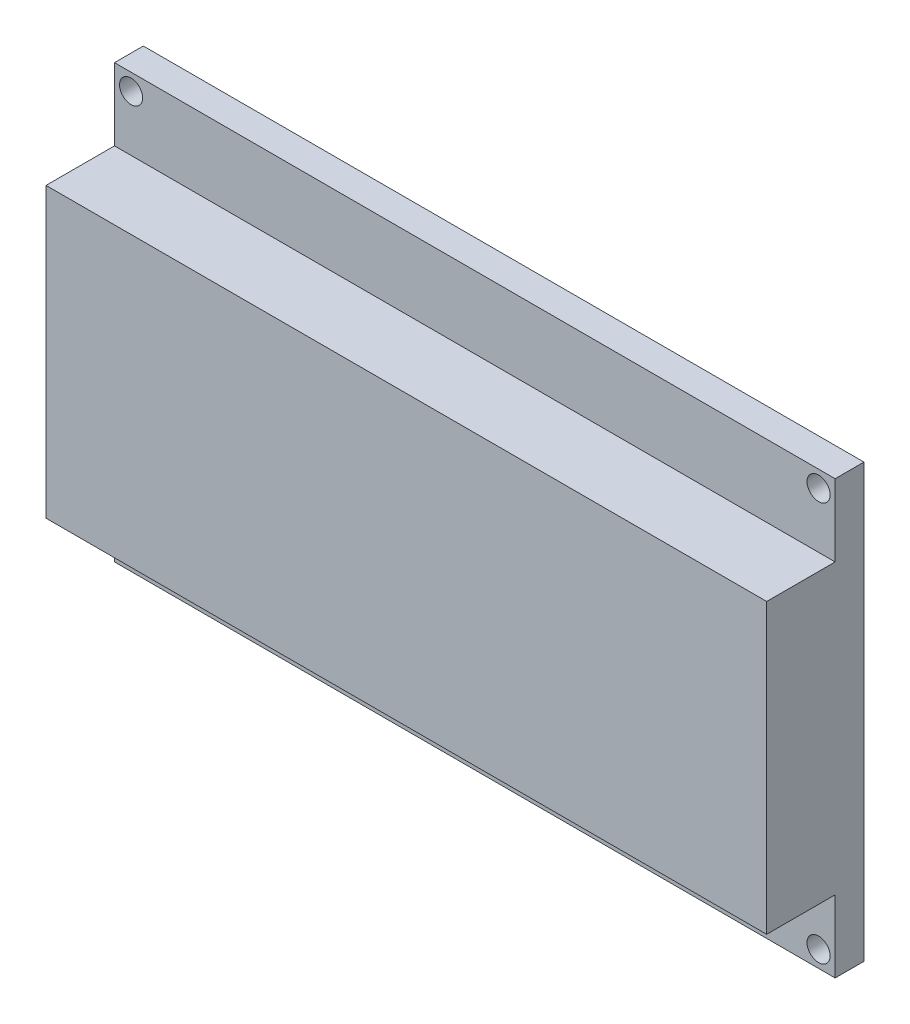
ISO-10303-21;
HEADER;
FILE_DESCRIPTION(('STEP AP214'),'2;1');
FILE_NAME('part.step','',(''),(''),'','','');
FILE_SCHEMA(('AUTOMOTIVE_DESIGN { 1 0 10303 214 1 1 1 1 }'));
ENDSEC;
DATA;
#1=APPLICATION_CONTEXT('core data for automotive mechanical design processes');
#2=APPLICATION_PROTOCOL_DEFINITION('international standard','automotive_design',2000,#1);
#3=PRODUCT_CONTEXT('',#1,'mechanical');
#4=PRODUCT('Part','Part','',(#3));
#5=PRODUCT_RELATED_PRODUCT_CATEGORY('part','',(#4));
#6=PRODUCT_DEFINITION_FORMATION('','',#4);
#7=PRODUCT_DEFINITION_CONTEXT('part definition',#1,'design');
#8=PRODUCT_DEFINITION('design','',#6,#7);
#9=PRODUCT_DEFINITION_SHAPE('','',#8);
#10=(LENGTH_UNIT() NAMED_UNIT(*) SI_UNIT(.MILLI.,.METRE.));
#11=(NAMED_UNIT(*) PLANE_ANGLE_UNIT() SI_UNIT($,.RADIAN.));
#12=(NAMED_UNIT(*) SI_UNIT($,.STERADIAN.) SOLID_ANGLE_UNIT());
#13=UNCERTAINTY_MEASURE_WITH_UNIT(LENGTH_MEASURE(1.E-05),#10,'distance_accuracy_value','');
#14=(GEOMETRIC_REPRESENTATION_CONTEXT(3) GLOBAL_UNCERTAINTY_ASSIGNED_CONTEXT((#13)) GLOBAL_UNIT_ASSIGNED_CONTEXT((#10,
#11,#12)) REPRESENTATION_CONTEXT('',''));
#15=CARTESIAN_POINT('',(0.,0.,0.));
#16=DIRECTION('',(0.,0.,1.));
#17=DIRECTION('',(1.,0.,0.));
#18=AXIS2_PLACEMENT_3D('',#15,#16,#17);
#19=CARTESIAN_POINT('',(0.,0.,4.));
#20=DIRECTION('',(0.,0.,-1.));
#21=DIRECTION('',(-1.,0.,0.));
#22=AXIS2_PLACEMENT_3D('',#19,#20,#21);
#23=PLANE('',#22);
#24=CARTESIAN_POINT('',(97.6999999999997,57.7,4.));
#25=DIRECTION('',(0.,0.,1.));
#26=DIRECTION('',(1.,0.,0.));
#27=AXIS2_PLACEMENT_3D('',#24,#25,#26);
#28=CIRCLE('',#27,1.60000000000001);
#29=CARTESIAN_POINT('',(99.2999999999997,57.7,4.));
#30=VERTEX_POINT('',#29);
#31=EDGE_CURVE('E139',#30,#30,#28,.T.);
#32=ORIENTED_EDGE('',*,*,#31,.F.);
#33=EDGE_LOOP('',(#32));
#34=FACE_BOUND('',#33,.T.);
#35=CARTESIAN_POINT('',(2.3,57.7,4.));
#36=DIRECTION('',(0.,0.,1.));
#37=DIRECTION('',(1.,0.,0.));
#38=AXIS2_PLACEMENT_3D('',#35,#36,#37);
#39=CIRCLE('',#38,1.6);
#40=CARTESIAN_POINT('',(3.9,57.7,4.));
#41=VERTEX_POINT('',#40);
#42=EDGE_CURVE('E145',#41,#41,#39,.T.);
#43=ORIENTED_EDGE('',*,*,#42,.F.);
#44=EDGE_LOOP('',(#43));
#45=FACE_BOUND('',#44,.T.);
#46=DIRECTION('',(-1.,0.,0.));
#47=VECTOR('',#46,1.);
#48=CARTESIAN_POINT('',(0.,50.,4.));
#49=LINE('',#48,#47);
#50=CARTESIAN_POINT('',(100.,50.,4.));
#51=VERTEX_POINT('',#50);
#52=CARTESIAN_POINT('',(0.,50.,4.));
#53=VERTEX_POINT('',#52);
#54=EDGE_CURVE('E48',#51,#53,#49,.T.);
#55=ORIENTED_EDGE('',*,*,#54,.F.);
#56=DIRECTION('',(0.,1.,0.));
#57=VECTOR('',#56,1.);
#58=CARTESIAN_POINT('',(100.,0.,4.));
#59=LINE('',#58,#57);
#60=CARTESIAN_POINT('',(100.,60.,4.));
#61=VERTEX_POINT('',#60);
#62=EDGE_CURVE('E155',#51,#61,#59,.T.);
#63=ORIENTED_EDGE('',*,*,#62,.T.);
#64=DIRECTION('',(-1.,0.,0.));
#65=VECTOR('',#64,1.);
#66=CARTESIAN_POINT('',(0.,60.,4.));
#67=LINE('',#66,#65);
#68=CARTESIAN_POINT('',(0.,60.,4.));
#69=VERTEX_POINT('',#68);
#70=EDGE_CURVE('E158',#61,#69,#67,.T.);
#71=ORIENTED_EDGE('',*,*,#70,.T.);
#72=DIRECTION('',(0.,-1.,0.));
#73=VECTOR('',#72,1.);
#74=CARTESIAN_POINT('',(0.,0.,4.));
#75=LINE('',#74,#73);
#76=EDGE_CURVE('E151',#69,#53,#75,.T.);
#77=ORIENTED_EDGE('',*,*,#76,.T.);
#78=EDGE_LOOP('',(#55,#63,#71,#77));
#79=FACE_BOUND('',#78,.T.);
#80=ADVANCED_FACE('F33',(#34,#45,#79),#23,.F.);
#81=CARTESIAN_POINT('',(2.30000000000033,2.3,4.));
#82=DIRECTION('',(0.,0.,1.));
#83=DIRECTION('',(1.,0.,0.));
#84=AXIS2_PLACEMENT_3D('',#81,#82,#83);
#85=CIRCLE('',#84,1.6);
#86=CARTESIAN_POINT('',(3.90000000000033,2.3,4.));
#87=VERTEX_POINT('',#86);
#88=EDGE_CURVE('E124',#87,#87,#85,.T.);
#89=ORIENTED_EDGE('',*,*,#88,.F.);
#90=EDGE_LOOP('',(#89));
#91=FACE_BOUND('',#90,.T.);
#92=CARTESIAN_POINT('',(97.7,2.3,4.));
#93=DIRECTION('',(0.,0.,1.));
#94=DIRECTION('',(1.,0.,0.));
#95=AXIS2_PLACEMENT_3D('',#92,#93,#94);
#96=CIRCLE('',#95,1.60000000000001);
#97=CARTESIAN_POINT('',(99.3,2.3,4.));
#98=VERTEX_POINT('',#97);
#99=EDGE_CURVE('E133',#98,#98,#96,.T.);
#100=ORIENTED_EDGE('',*,*,#99,.F.);
#101=EDGE_LOOP('',(#100));
#102=FACE_BOUND('',#101,.T.);
#103=DIRECTION('',(1.,0.,0.));
#104=VECTOR('',#103,1.);
#105=CARTESIAN_POINT('',(0.,10.,4.));
#106=LINE('',#105,#104);
#107=CARTESIAN_POINT('',(0.,10.,4.));
#108=VERTEX_POINT('',#107);
#109=CARTESIAN_POINT('',(100.,10.,4.));
#110=VERTEX_POINT('',#109);
#111=EDGE_CURVE('E56',#108,#110,#106,.T.);
#112=ORIENTED_EDGE('',*,*,#111,.F.);
#113=CARTESIAN_POINT('',(0.,0.,4.));
#114=VERTEX_POINT('',#113);
#115=EDGE_CURVE('E120',#108,#114,#75,.T.);
#116=ORIENTED_EDGE('',*,*,#115,.T.);
#117=DIRECTION('',(1.,0.,0.));
#118=VECTOR('',#117,1.);
#119=CARTESIAN_POINT('',(0.,0.,4.));
#120=LINE('',#119,#118);
#121=CARTESIAN_POINT('',(100.,0.,4.));
#122=VERTEX_POINT('',#121);
#123=EDGE_CURVE('E153',#114,#122,#120,.T.);
#124=ORIENTED_EDGE('',*,*,#123,.T.);
#125=EDGE_CURVE('E156',#122,#110,#59,.T.);
#126=ORIENTED_EDGE('',*,*,#125,.T.);
#127=EDGE_LOOP('',(#112,#116,#124,#126));
#128=FACE_BOUND('',#127,.T.);
#129=ADVANCED_FACE('F211',(#91,#102,#128),#23,.F.);
#130=CARTESIAN_POINT('',(0.,0.,0.));
#131=DIRECTION('',(0.,0.,-1.));
#132=DIRECTION('',(-1.,0.,0.));
#133=AXIS2_PLACEMENT_3D('',#130,#131,#132);
#134=PLANE('',#133);
#135=CARTESIAN_POINT('',(97.7,2.3,0.));
#136=DIRECTION('',(0.,0.,1.));
#137=DIRECTION('',(1.,0.,0.));
#138=AXIS2_PLACEMENT_3D('',#135,#136,#137);
#139=CIRCLE('',#138,1.60000000000001);
#140=CARTESIAN_POINT('',(99.3,2.3,0.));
#141=VERTEX_POINT('',#140);
#142=EDGE_CURVE('E131',#141,#141,#139,.T.);
#143=ORIENTED_EDGE('',*,*,#142,.T.);
#144=EDGE_LOOP('',(#143));
#145=FACE_BOUND('',#144,.T.);
#146=CARTESIAN_POINT('',(2.3,57.7,0.));
#147=DIRECTION('',(0.,0.,1.));
#148=DIRECTION('',(1.,0.,0.));
#149=AXIS2_PLACEMENT_3D('',#146,#147,#148);
#150=CIRCLE('',#149,1.6);
#151=CARTESIAN_POINT('',(3.9,57.7,0.));
#152=VERTEX_POINT('',#151);
#153=EDGE_CURVE('E142',#152,#152,#150,.T.);
#154=ORIENTED_EDGE('',*,*,#153,.T.);
#155=EDGE_LOOP('',(#154));
#156=FACE_BOUND('',#155,.T.);
#157=DIRECTION('',(0.,-1.,0.));
#158=VECTOR('',#157,1.);
#159=CARTESIAN_POINT('',(0.,0.,0.));
#160=LINE('',#159,#158);
#161=CARTESIAN_POINT('',(0.,60.,0.));
#162=VERTEX_POINT('',#161);
#163=CARTESIAN_POINT('',(0.,0.,0.));
#164=VERTEX_POINT('',#163);
#165=EDGE_CURVE('E148',#162,#164,#160,.T.);
#166=ORIENTED_EDGE('',*,*,#165,.F.);
#167=DIRECTION('',(-1.,0.,0.));
#168=VECTOR('',#167,1.);
#169=CARTESIAN_POINT('',(0.,60.,0.));
#170=LINE('',#169,#168);
#171=CARTESIAN_POINT('',(100.,60.,0.));
#172=VERTEX_POINT('',#171);
#173=EDGE_CURVE('E166',#172,#162,#170,.T.);
#174=ORIENTED_EDGE('',*,*,#173,.F.);
#175=DIRECTION('',(0.,1.,0.));
#176=VECTOR('',#175,1.);
#177=CARTESIAN_POINT('',(100.,0.,0.));
#178=LINE('',#177,#176);
#179=CARTESIAN_POINT('',(100.,0.,0.));
#180=VERTEX_POINT('',#179);
#181=EDGE_CURVE('E164',#180,#172,#178,.T.);
#182=ORIENTED_EDGE('',*,*,#181,.F.);
#183=DIRECTION('',(1.,0.,0.));
#184=VECTOR('',#183,1.);
#185=CARTESIAN_POINT('',(0.,0.,0.));
#186=LINE('',#185,#184);
#187=EDGE_CURVE('E162',#164,#180,#186,.T.);
#188=ORIENTED_EDGE('',*,*,#187,.F.);
#189=EDGE_LOOP('',(#166,#174,#182,#188));
#190=FACE_BOUND('',#189,.T.);
#191=CARTESIAN_POINT('',(97.6999999999997,57.7,0.));
#192=DIRECTION('',(0.,0.,1.));
#193=DIRECTION('',(1.,0.,0.));
#194=AXIS2_PLACEMENT_3D('',#191,#192,#193);
#195=CIRCLE('',#194,1.60000000000001);
#196=CARTESIAN_POINT('',(99.2999999999997,57.7,0.));
#197=VERTEX_POINT('',#196);
#198=EDGE_CURVE('E136',#197,#197,#195,.T.);
#199=ORIENTED_EDGE('',*,*,#198,.T.);
#200=EDGE_LOOP('',(#199));
#201=FACE_BOUND('',#200,.T.);
#202=CARTESIAN_POINT('',(2.30000000000033,2.3,0.));
#203=DIRECTION('',(0.,0.,1.));
#204=DIRECTION('',(1.,0.,0.));
#205=AXIS2_PLACEMENT_3D('',#202,#203,#204);
#206=CIRCLE('',#205,1.6);
#207=CARTESIAN_POINT('',(3.90000000000033,2.3,0.));
#208=VERTEX_POINT('',#207);
#209=EDGE_CURVE('E121',#208,#208,#206,.T.);
#210=ORIENTED_EDGE('',*,*,#209,.T.);
#211=EDGE_LOOP('',(#210));
#212=FACE_BOUND('',#211,.T.);
#213=ADVANCED_FACE('F184',(#145,#156,#190,#201,#212),#134,.T.);
#214=CARTESIAN_POINT('',(0.,0.,4.));
#215=DIRECTION('',(1.,0.,0.));
#216=DIRECTION('',(0.,0.,-1.));
#217=AXIS2_PLACEMENT_3D('',#214,#215,#216);
#218=PLANE('',#217);
#219=ORIENTED_EDGE('',*,*,#165,.T.);
#220=DIRECTION('',(0.,0.,-1.));
#221=VECTOR('',#220,1.);
#222=CARTESIAN_POINT('',(0.,0.,4.));
#223=LINE('',#222,#221);
#224=EDGE_CURVE('E11',#114,#164,#223,.T.);
#225=ORIENTED_EDGE('',*,*,#224,.F.);
#226=ORIENTED_EDGE('',*,*,#115,.F.);
#227=DIRECTION('',(0.,0.,-1.));
#228=VECTOR('',#227,1.);
#229=CARTESIAN_POINT('',(0.,10.,13.5));
#230=LINE('',#229,#228);
#231=CARTESIAN_POINT('',(0.,10.,13.5));
#232=VERTEX_POINT('',#231);
#233=EDGE_CURVE('E102',#232,#108,#230,.T.);
#234=ORIENTED_EDGE('',*,*,#233,.F.);
#235=DIRECTION('',(0.,-1.,0.));
#236=VECTOR('',#235,1.);
#237=CARTESIAN_POINT('',(0.,50.,13.5));
#238=LINE('',#237,#236);
#239=CARTESIAN_POINT('',(0.,50.,13.5));
#240=VERTEX_POINT('',#239);
#241=EDGE_CURVE('E108',#240,#232,#238,.T.);
#242=ORIENTED_EDGE('',*,*,#241,.F.);
#243=DIRECTION('',(0.,0.,-1.));
#244=VECTOR('',#243,1.);
#245=CARTESIAN_POINT('',(0.,50.,13.5));
#246=LINE('',#245,#244);
#247=EDGE_CURVE('E191',#240,#53,#246,.T.);
#248=ORIENTED_EDGE('',*,*,#247,.T.);
#249=ORIENTED_EDGE('',*,*,#76,.F.);
#250=DIRECTION('',(0.,0.,-1.));
#251=VECTOR('',#250,1.);
#252=CARTESIAN_POINT('',(0.,60.,4.));
#253=LINE('',#252,#251);
#254=EDGE_CURVE('E160',#69,#162,#253,.T.);
#255=ORIENTED_EDGE('',*,*,#254,.T.);
#256=EDGE_LOOP('',(#219,#225,#226,#234,#242,#248,#249,#255));
#257=FACE_BOUND('',#256,.T.);
#258=ADVANCED_FACE('F35',(#257),#218,.F.);
#259=CARTESIAN_POINT('',(0.,0.,4.));
#260=DIRECTION('',(0.,1.,0.));
#261=DIRECTION('',(0.,0.,1.));
#262=AXIS2_PLACEMENT_3D('',#259,#260,#261);
#263=PLANE('',#262);
#264=ORIENTED_EDGE('',*,*,#187,.T.);
#265=DIRECTION('',(0.,0.,-1.));
#266=VECTOR('',#265,1.);
#267=CARTESIAN_POINT('',(100.,0.,4.));
#268=LINE('',#267,#266);
#269=EDGE_CURVE('E41',#122,#180,#268,.T.);
#270=ORIENTED_EDGE('',*,*,#269,.F.);
#271=ORIENTED_EDGE('',*,*,#123,.F.);
#272=ORIENTED_EDGE('',*,*,#224,.T.);
#273=EDGE_LOOP('',(#264,#270,#271,#272));
#274=FACE_BOUND('',#273,.T.);
#275=ADVANCED_FACE('F230',(#274),#263,.F.);
#276=CARTESIAN_POINT('',(100.,0.,4.));
#277=DIRECTION('',(-1.,0.,0.));
#278=DIRECTION('',(0.,0.,1.));
#279=AXIS2_PLACEMENT_3D('',#276,#277,#278);
#280=PLANE('',#279);
#281=ORIENTED_EDGE('',*,*,#181,.T.);
#282=DIRECTION('',(0.,0.,-1.));
#283=VECTOR('',#282,1.);
#284=CARTESIAN_POINT('',(100.,60.,4.));
#285=LINE('',#284,#283);
#286=EDGE_CURVE('E170',#61,#172,#285,.T.);
#287=ORIENTED_EDGE('',*,*,#286,.F.);
#288=ORIENTED_EDGE('',*,*,#62,.F.);
#289=DIRECTION('',(0.,0.,-1.));
#290=VECTOR('',#289,1.);
#291=CARTESIAN_POINT('',(100.,50.,13.5));
#292=LINE('',#291,#290);
#293=CARTESIAN_POINT('',(100.,50.,13.5));
#294=VERTEX_POINT('',#293);
#295=EDGE_CURVE('E126',#294,#51,#292,.T.);
#296=ORIENTED_EDGE('',*,*,#295,.F.);
#297=DIRECTION('',(0.,1.,0.));
#298=VECTOR('',#297,1.);
#299=CARTESIAN_POINT('',(100.,50.,13.5));
#300=LINE('',#299,#298);
#301=CARTESIAN_POINT('',(100.,10.,13.5));
#302=VERTEX_POINT('',#301);
#303=EDGE_CURVE('E107',#302,#294,#300,.T.);
#304=ORIENTED_EDGE('',*,*,#303,.F.);
#305=DIRECTION('',(0.,0.,-1.));
#306=VECTOR('',#305,1.);
#307=CARTESIAN_POINT('',(100.,10.,13.5));
#308=LINE('',#307,#306);
#309=EDGE_CURVE('E104',#302,#110,#308,.T.);
#310=ORIENTED_EDGE('',*,*,#309,.T.);
#311=ORIENTED_EDGE('',*,*,#125,.F.);
#312=ORIENTED_EDGE('',*,*,#269,.T.);
#313=EDGE_LOOP('',(#281,#287,#288,#296,#304,#310,#311,#312));
#314=FACE_BOUND('',#313,.T.);
#315=ADVANCED_FACE('F177',(#314),#280,.F.);
#316=CARTESIAN_POINT('',(0.,60.,4.));
#317=DIRECTION('',(0.,-1.,0.));
#318=DIRECTION('',(0.,0.,-1.));
#319=AXIS2_PLACEMENT_3D('',#316,#317,#318);
#320=PLANE('',#319);
#321=ORIENTED_EDGE('',*,*,#173,.T.);
#322=ORIENTED_EDGE('',*,*,#254,.F.);
#323=ORIENTED_EDGE('',*,*,#70,.F.);
#324=ORIENTED_EDGE('',*,*,#286,.T.);
#325=EDGE_LOOP('',(#321,#322,#323,#324));
#326=FACE_BOUND('',#325,.T.);
#327=ADVANCED_FACE('F188',(#326),#320,.F.);
#328=CARTESIAN_POINT('',(2.3,57.7,4.));
#329=DIRECTION('',(0.,0.,-1.));
#330=DIRECTION('',(-1.,0.,0.));
#331=AXIS2_PLACEMENT_3D('',#328,#329,#330);
#332=CYLINDRICAL_SURFACE('',#331,1.6);
#333=ORIENTED_EDGE('',*,*,#42,.T.);
#334=EDGE_LOOP('',(#333));
#335=FACE_BOUND('',#334,.T.);
#336=ORIENTED_EDGE('',*,*,#153,.F.);
#337=EDGE_LOOP('',(#336));
#338=FACE_BOUND('',#337,.T.);
#339=ADVANCED_FACE('F222',(#335,#338),#332,.F.);
#340=CARTESIAN_POINT('',(97.6999999999997,57.7,4.));
#341=DIRECTION('',(0.,0.,-1.));
#342=DIRECTION('',(-1.,0.,0.));
#343=AXIS2_PLACEMENT_3D('',#340,#341,#342);
#344=CYLINDRICAL_SURFACE('',#343,1.60000000000001);
#345=ORIENTED_EDGE('',*,*,#31,.T.);
#346=EDGE_LOOP('',(#345));
#347=FACE_BOUND('',#346,.T.);
#348=ORIENTED_EDGE('',*,*,#198,.F.);
#349=EDGE_LOOP('',(#348));
#350=FACE_BOUND('',#349,.T.);
#351=ADVANCED_FACE('F269',(#347,#350),#344,.F.);
#352=CARTESIAN_POINT('',(97.7,2.3,4.));
#353=DIRECTION('',(0.,0.,-1.));
#354=DIRECTION('',(-1.,0.,0.));
#355=AXIS2_PLACEMENT_3D('',#352,#353,#354);
#356=CYLINDRICAL_SURFACE('',#355,1.60000000000001);
#357=ORIENTED_EDGE('',*,*,#99,.T.);
#358=EDGE_LOOP('',(#357));
#359=FACE_BOUND('',#358,.T.);
#360=ORIENTED_EDGE('',*,*,#142,.F.);
#361=EDGE_LOOP('',(#360));
#362=FACE_BOUND('',#361,.T.);
#363=ADVANCED_FACE('F259',(#359,#362),#356,.F.);
#364=CARTESIAN_POINT('',(2.30000000000033,2.3,4.));
#365=DIRECTION('',(0.,0.,-1.));
#366=DIRECTION('',(-1.,0.,0.));
#367=AXIS2_PLACEMENT_3D('',#364,#365,#366);
#368=CYLINDRICAL_SURFACE('',#367,1.6);
#369=ORIENTED_EDGE('',*,*,#88,.T.);
#370=EDGE_LOOP('',(#369));
#371=FACE_BOUND('',#370,.T.);
#372=ORIENTED_EDGE('',*,*,#209,.F.);
#373=EDGE_LOOP('',(#372));
#374=FACE_BOUND('',#373,.T.);
#375=ADVANCED_FACE('F208',(#371,#374),#368,.F.);
#376=CARTESIAN_POINT('',(0.,10.,13.5));
#377=DIRECTION('',(0.,1.,0.));
#378=DIRECTION('',(0.,0.,1.));
#379=AXIS2_PLACEMENT_3D('',#376,#377,#378);
#380=PLANE('',#379);
#381=ORIENTED_EDGE('',*,*,#111,.T.);
#382=ORIENTED_EDGE('',*,*,#309,.F.);
#383=DIRECTION('',(1.,0.,0.));
#384=VECTOR('',#383,1.);
#385=CARTESIAN_POINT('',(0.,10.,13.5));
#386=LINE('',#385,#384);
#387=EDGE_CURVE('E98',#232,#302,#386,.T.);
#388=ORIENTED_EDGE('',*,*,#387,.F.);
#389=ORIENTED_EDGE('',*,*,#233,.T.);
#390=EDGE_LOOP('',(#381,#382,#388,#389));
#391=FACE_BOUND('',#390,.T.);
#392=ADVANCED_FACE('F100',(#391),#380,.F.);
#393=CARTESIAN_POINT('',(0.,50.,13.5));
#394=DIRECTION('',(0.,-1.,0.));
#395=DIRECTION('',(0.,0.,-1.));
#396=AXIS2_PLACEMENT_3D('',#393,#394,#395);
#397=PLANE('',#396);
#398=ORIENTED_EDGE('',*,*,#54,.T.);
#399=ORIENTED_EDGE('',*,*,#247,.F.);
#400=DIRECTION('',(-1.,0.,0.));
#401=VECTOR('',#400,1.);
#402=CARTESIAN_POINT('',(0.,50.,13.5));
#403=LINE('',#402,#401);
#404=EDGE_CURVE('E113',#294,#240,#403,.T.);
#405=ORIENTED_EDGE('',*,*,#404,.F.);
#406=ORIENTED_EDGE('',*,*,#295,.T.);
#407=EDGE_LOOP('',(#398,#399,#405,#406));
#408=FACE_BOUND('',#407,.T.);
#409=ADVANCED_FACE('F194',(#408),#397,.F.);
#410=CARTESIAN_POINT('',(0.,0.,13.5));
#411=DIRECTION('',(0.,0.,1.));
#412=DIRECTION('',(1.,0.,0.));
#413=AXIS2_PLACEMENT_3D('',#410,#411,#412);
#414=PLANE('',#413);
#415=ORIENTED_EDGE('',*,*,#241,.T.);
#416=ORIENTED_EDGE('',*,*,#387,.T.);
#417=ORIENTED_EDGE('',*,*,#303,.T.);
#418=ORIENTED_EDGE('',*,*,#404,.T.);
#419=EDGE_LOOP('',(#415,#416,#417,#418));
#420=FACE_BOUND('',#419,.T.);
#421=ADVANCED_FACE('F111',(#420),#414,.T.);
#422=CLOSED_SHELL('',(#80,#129,#213,#258,#275,#315,#327,#339,#351,#363,#375,#392,#409,#421));
#423=MANIFOLD_SOLID_BREP('B2',#422);
#424=ADVANCED_BREP_SHAPE_REPRESENTATION('',(#18,#423),#14);
#425=SHAPE_DEFINITION_REPRESENTATION(#9,#424);
ENDSEC;
END-ISO-10303-21;
